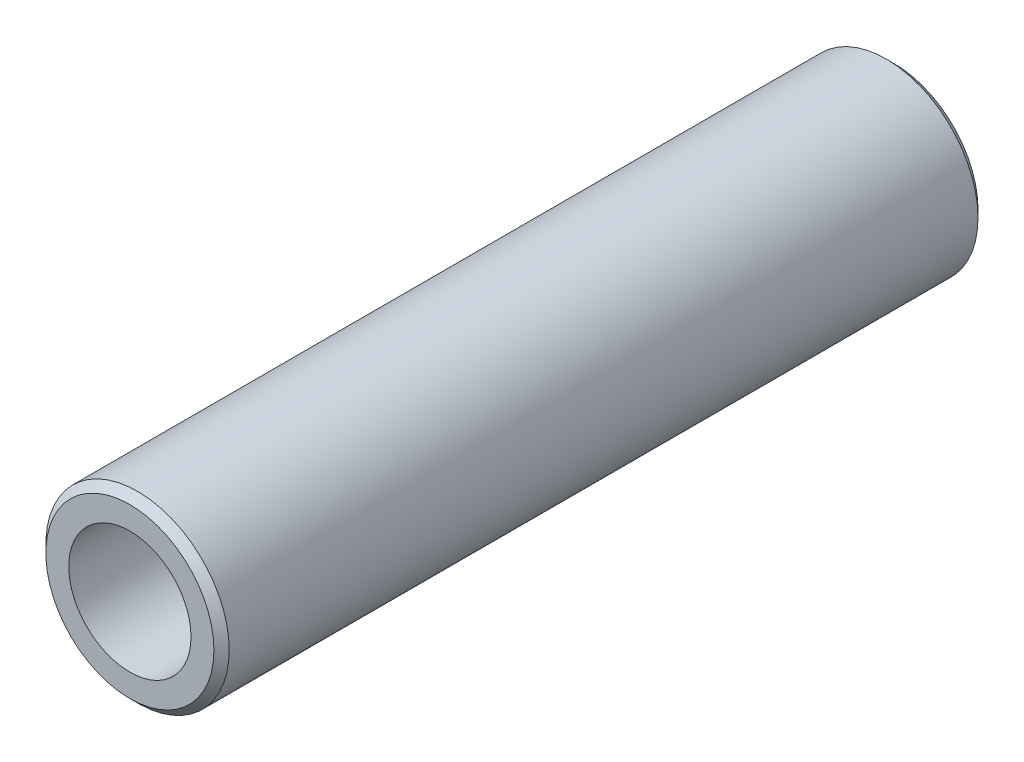
ISO-10303-21;
HEADER;
FILE_DESCRIPTION(('STEP AP214'),'2;1');
FILE_NAME('part.step','',(''),(''),'','','');
FILE_SCHEMA(('AUTOMOTIVE_DESIGN { 1 0 10303 214 1 1 1 1 }'));
ENDSEC;
DATA;
#1=APPLICATION_CONTEXT('core data for automotive mechanical design processes');
#2=APPLICATION_PROTOCOL_DEFINITION('international standard','automotive_design',2000,#1);
#3=PRODUCT_CONTEXT('',#1,'mechanical');
#4=PRODUCT('Part','Part','',(#3));
#5=PRODUCT_RELATED_PRODUCT_CATEGORY('part','',(#4));
#6=PRODUCT_DEFINITION_FORMATION('','',#4);
#7=PRODUCT_DEFINITION_CONTEXT('part definition',#1,'design');
#8=PRODUCT_DEFINITION('design','',#6,#7);
#9=PRODUCT_DEFINITION_SHAPE('','',#8);
#10=(LENGTH_UNIT() NAMED_UNIT(*) SI_UNIT(.MILLI.,.METRE.));
#11=(NAMED_UNIT(*) PLANE_ANGLE_UNIT() SI_UNIT($,.RADIAN.));
#12=(NAMED_UNIT(*) SI_UNIT($,.STERADIAN.) SOLID_ANGLE_UNIT());
#13=UNCERTAINTY_MEASURE_WITH_UNIT(LENGTH_MEASURE(1.E-05),#10,'distance_accuracy_value','');
#14=(GEOMETRIC_REPRESENTATION_CONTEXT(3) GLOBAL_UNCERTAINTY_ASSIGNED_CONTEXT((#13)) GLOBAL_UNIT_ASSIGNED_CONTEXT((#10,
#11,#12)) REPRESENTATION_CONTEXT('',''));
#15=CARTESIAN_POINT('',(0.,0.,0.));
#16=DIRECTION('',(0.,0.,1.));
#17=DIRECTION('',(1.,0.,0.));
#18=AXIS2_PLACEMENT_3D('',#15,#16,#17);
#19=CARTESIAN_POINT('',(0.,0.,12.5));
#20=DIRECTION('',(0.,0.,1.));
#21=DIRECTION('',(1.,0.,0.));
#22=AXIS2_PLACEMENT_3D('',#19,#20,#21);
#23=PLANE('',#22);
#24=CARTESIAN_POINT('',(0.,0.,12.5));
#25=DIRECTION('',(0.,0.,1.));
#26=DIRECTION('',(1.,0.,0.));
#27=AXIS2_PLACEMENT_3D('',#24,#25,#26);
#28=CIRCLE('',#27,2.75);
#29=CARTESIAN_POINT('',(2.75,0.,12.5));
#30=VERTEX_POINT('',#29);
#31=EDGE_CURVE('E10',#30,#30,#28,.T.);
#32=ORIENTED_EDGE('',*,*,#31,.T.);
#33=EDGE_LOOP('',(#32));
#34=FACE_BOUND('',#33,.T.);
#35=CARTESIAN_POINT('',(0.,0.,12.5));
#36=DIRECTION('',(0.,0.,1.));
#37=DIRECTION('',(1.,0.,0.));
#38=AXIS2_PLACEMENT_3D('',#35,#36,#37);
#39=CIRCLE('',#38,2.);
#40=CARTESIAN_POINT('',(2.,0.,12.5));
#41=VERTEX_POINT('',#40);
#42=EDGE_CURVE('E54',#41,#41,#39,.T.);
#43=ORIENTED_EDGE('',*,*,#42,.F.);
#44=EDGE_LOOP('',(#43));
#45=FACE_BOUND('',#44,.T.);
#46=ADVANCED_FACE('F34',(#34,#45),#23,.T.);
#47=CARTESIAN_POINT('',(0.,0.,-12.5));
#48=DIRECTION('',(0.,0.,1.));
#49=DIRECTION('',(1.,0.,0.));
#50=AXIS2_PLACEMENT_3D('',#47,#48,#49);
#51=PLANE('',#50);
#52=CARTESIAN_POINT('',(0.,0.,-12.5));
#53=DIRECTION('',(0.,0.,1.));
#54=DIRECTION('',(1.,0.,0.));
#55=AXIS2_PLACEMENT_3D('',#52,#53,#54);
#56=CIRCLE('',#55,2.75);
#57=CARTESIAN_POINT('',(2.75,0.,-12.5));
#58=VERTEX_POINT('',#57);
#59=EDGE_CURVE('E41',#58,#58,#56,.F.);
#60=ORIENTED_EDGE('',*,*,#59,.T.);
#61=EDGE_LOOP('',(#60));
#62=FACE_BOUND('',#61,.T.);
#63=CARTESIAN_POINT('',(0.,0.,-12.5));
#64=DIRECTION('',(0.,0.,1.));
#65=DIRECTION('',(1.,0.,0.));
#66=AXIS2_PLACEMENT_3D('',#63,#64,#65);
#67=CIRCLE('',#66,2.);
#68=CARTESIAN_POINT('',(2.,0.,-12.5));
#69=VERTEX_POINT('',#68);
#70=EDGE_CURVE('E55',#69,#69,#67,.T.);
#71=ORIENTED_EDGE('',*,*,#70,.T.);
#72=EDGE_LOOP('',(#71));
#73=FACE_BOUND('',#72,.T.);
#74=ADVANCED_FACE('F65',(#62,#73),#51,.F.);
#75=CARTESIAN_POINT('',(0.,0.,12.5));
#76=DIRECTION('',(0.,0.,-1.));
#77=DIRECTION('',(-1.,0.,0.));
#78=AXIS2_PLACEMENT_3D('',#75,#76,#77);
#79=CYLINDRICAL_SURFACE('',#78,3.);
#80=CARTESIAN_POINT('',(0.,0.,-12.25));
#81=DIRECTION('',(0.,0.,1.));
#82=DIRECTION('',(1.,0.,0.));
#83=AXIS2_PLACEMENT_3D('',#80,#81,#82);
#84=CIRCLE('',#83,3.);
#85=CARTESIAN_POINT('',(3.,0.,-12.25));
#86=VERTEX_POINT('',#85);
#87=EDGE_CURVE('E45',#86,#86,#84,.T.);
#88=ORIENTED_EDGE('',*,*,#87,.T.);
#89=EDGE_LOOP('',(#88));
#90=FACE_BOUND('',#89,.T.);
#91=CARTESIAN_POINT('',(0.,0.,12.25));
#92=DIRECTION('',(0.,0.,1.));
#93=DIRECTION('',(1.,0.,0.));
#94=AXIS2_PLACEMENT_3D('',#91,#92,#93);
#95=CIRCLE('',#94,3.);
#96=CARTESIAN_POINT('',(3.,0.,12.25));
#97=VERTEX_POINT('',#96);
#98=EDGE_CURVE('E49',#97,#97,#95,.F.);
#99=ORIENTED_EDGE('',*,*,#98,.T.);
#100=EDGE_LOOP('',(#99));
#101=FACE_BOUND('',#100,.T.);
#102=ADVANCED_FACE('F70',(#90,#101),#79,.T.);
#103=CARTESIAN_POINT('',(0.,0.,12.5));
#104=DIRECTION('',(0.,0.,-1.));
#105=DIRECTION('',(-1.,0.,0.));
#106=AXIS2_PLACEMENT_3D('',#103,#104,#105);
#107=CYLINDRICAL_SURFACE('',#106,2.);
#108=ORIENTED_EDGE('',*,*,#42,.T.);
#109=EDGE_LOOP('',(#108));
#110=FACE_BOUND('',#109,.T.);
#111=ORIENTED_EDGE('',*,*,#70,.F.);
#112=EDGE_LOOP('',(#111));
#113=FACE_BOUND('',#112,.T.);
#114=ADVANCED_FACE('F61',(#110,#113),#107,.F.);
#115=CARTESIAN_POINT('',(0.,0.,-12.25));
#116=DIRECTION('',(0.,0.,1.));
#117=DIRECTION('',(1.,0.,0.));
#118=AXIS2_PLACEMENT_3D('',#115,#116,#117);
#119=CONICAL_SURFACE('',#118,3.,0.785398163397456);
#120=ORIENTED_EDGE('',*,*,#59,.F.);
#121=EDGE_LOOP('',(#120));
#122=FACE_BOUND('',#121,.T.);
#123=ORIENTED_EDGE('',*,*,#87,.F.);
#124=EDGE_LOOP('',(#123));
#125=FACE_BOUND('',#124,.T.);
#126=ADVANCED_FACE('F76',(#122,#125),#119,.T.);
#127=CARTESIAN_POINT('',(0.,0.,12.5));
#128=DIRECTION('',(0.,0.,-1.));
#129=DIRECTION('',(-1.,0.,0.));
#130=AXIS2_PLACEMENT_3D('',#127,#128,#129);
#131=CONICAL_SURFACE('',#130,2.75,0.785398163397449);
#132=ORIENTED_EDGE('',*,*,#98,.F.);
#133=EDGE_LOOP('',(#132));
#134=FACE_BOUND('',#133,.T.);
#135=ORIENTED_EDGE('',*,*,#31,.F.);
#136=EDGE_LOOP('',(#135));
#137=FACE_BOUND('',#136,.T.);
#138=ADVANCED_FACE('F36',(#134,#137),#131,.T.);
#139=CLOSED_SHELL('',(#46,#74,#102,#114,#126,#138));
#140=MANIFOLD_SOLID_BREP('B2',#139);
#141=ADVANCED_BREP_SHAPE_REPRESENTATION('',(#18,#140),#14);
#142=SHAPE_DEFINITION_REPRESENTATION(#9,#141);
ENDSEC;
END-ISO-10303-21;
